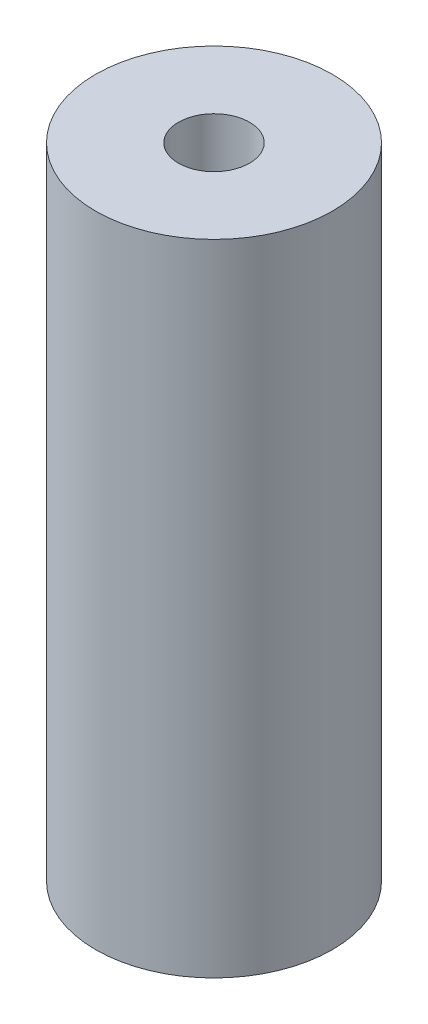
ISO-10303-21;
HEADER;
FILE_DESCRIPTION(('STEP AP214'),'2;1');
FILE_NAME('part.step','',(''),(''),'','','');
FILE_SCHEMA(('AUTOMOTIVE_DESIGN { 1 0 10303 214 1 1 1 1 }'));
ENDSEC;
DATA;
#1=APPLICATION_CONTEXT('core data for automotive mechanical design processes');
#2=APPLICATION_PROTOCOL_DEFINITION('international standard','automotive_design',2000,#1);
#3=PRODUCT_CONTEXT('',#1,'mechanical');
#4=PRODUCT('Part','Part','',(#3));
#5=PRODUCT_RELATED_PRODUCT_CATEGORY('part','',(#4));
#6=PRODUCT_DEFINITION_FORMATION('','',#4);
#7=PRODUCT_DEFINITION_CONTEXT('part definition',#1,'design');
#8=PRODUCT_DEFINITION('design','',#6,#7);
#9=PRODUCT_DEFINITION_SHAPE('','',#8);
#10=(LENGTH_UNIT() NAMED_UNIT(*) SI_UNIT(.MILLI.,.METRE.));
#11=(NAMED_UNIT(*) PLANE_ANGLE_UNIT() SI_UNIT($,.RADIAN.));
#12=(NAMED_UNIT(*) SI_UNIT($,.STERADIAN.) SOLID_ANGLE_UNIT());
#13=UNCERTAINTY_MEASURE_WITH_UNIT(LENGTH_MEASURE(1.E-05),#10,'distance_accuracy_value','');
#14=(GEOMETRIC_REPRESENTATION_CONTEXT(3) GLOBAL_UNCERTAINTY_ASSIGNED_CONTEXT((#13)) GLOBAL_UNIT_ASSIGNED_CONTEXT((#10,
#11,#12)) REPRESENTATION_CONTEXT('',''));
#15=CARTESIAN_POINT('',(0.,0.,0.));
#16=DIRECTION('',(0.,0.,1.));
#17=DIRECTION('',(1.,0.,0.));
#18=AXIS2_PLACEMENT_3D('',#15,#16,#17);
#19=CARTESIAN_POINT('',(0.,27.,0.));
#20=DIRECTION('',(0.,-1.,0.));
#21=DIRECTION('',(0.,0.,-1.));
#22=AXIS2_PLACEMENT_3D('',#19,#20,#21);
#23=CYLINDRICAL_SURFACE('',#22,5.);
#24=CARTESIAN_POINT('',(0.,27.,0.));
#25=DIRECTION('',(0.,1.,0.));
#26=DIRECTION('',(0.,0.,1.));
#27=AXIS2_PLACEMENT_3D('',#24,#25,#26);
#28=CIRCLE('',#27,5.);
#29=CARTESIAN_POINT('',(0.,27.,5.));
#30=VERTEX_POINT('',#29);
#31=EDGE_CURVE('E10',#30,#30,#28,.T.);
#32=ORIENTED_EDGE('',*,*,#31,.F.);
#33=EDGE_LOOP('',(#32));
#34=FACE_BOUND('',#33,.T.);
#35=CARTESIAN_POINT('',(0.,0.,0.));
#36=DIRECTION('',(0.,1.,0.));
#37=DIRECTION('',(0.,0.,1.));
#38=AXIS2_PLACEMENT_3D('',#35,#36,#37);
#39=CIRCLE('',#38,5.);
#40=CARTESIAN_POINT('',(0.,0.,5.));
#41=VERTEX_POINT('',#40);
#42=EDGE_CURVE('E33',#41,#41,#39,.T.);
#43=ORIENTED_EDGE('',*,*,#42,.T.);
#44=EDGE_LOOP('',(#43));
#45=FACE_BOUND('',#44,.T.);
#46=ADVANCED_FACE('F30',(#34,#45),#23,.T.);
#47=CARTESIAN_POINT('',(0.,27.,0.));
#48=DIRECTION('',(0.,1.,0.));
#49=DIRECTION('',(0.,0.,1.));
#50=AXIS2_PLACEMENT_3D('',#47,#48,#49);
#51=PLANE('',#50);
#52=CARTESIAN_POINT('',(0.,27.,0.));
#53=DIRECTION('',(0.,1.,0.));
#54=DIRECTION('',(0.,0.,1.));
#55=AXIS2_PLACEMENT_3D('',#52,#53,#54);
#56=CIRCLE('',#55,1.5);
#57=CARTESIAN_POINT('',(0.,27.,1.5));
#58=VERTEX_POINT('',#57);
#59=EDGE_CURVE('E42',#58,#58,#56,.T.);
#60=ORIENTED_EDGE('',*,*,#59,.F.);
#61=EDGE_LOOP('',(#60));
#62=FACE_BOUND('',#61,.T.);
#63=ORIENTED_EDGE('',*,*,#31,.T.);
#64=EDGE_LOOP('',(#63));
#65=FACE_BOUND('',#64,.T.);
#66=ADVANCED_FACE('F67',(#62,#65),#51,.T.);
#67=CARTESIAN_POINT('',(0.,0.,0.));
#68=DIRECTION('',(0.,1.,0.));
#69=DIRECTION('',(0.,0.,1.));
#70=AXIS2_PLACEMENT_3D('',#67,#68,#69);
#71=PLANE('',#70);
#72=CARTESIAN_POINT('',(0.,0.,0.));
#73=DIRECTION('',(0.,-1.,0.));
#74=DIRECTION('',(0.,0.,-1.));
#75=AXIS2_PLACEMENT_3D('',#72,#73,#74);
#76=CIRCLE('',#75,1.5);
#77=CARTESIAN_POINT('',(0.,0.,-1.5));
#78=VERTEX_POINT('',#77);
#79=EDGE_CURVE('E48',#78,#78,#76,.T.);
#80=ORIENTED_EDGE('',*,*,#79,.F.);
#81=EDGE_LOOP('',(#80));
#82=FACE_BOUND('',#81,.T.);
#83=ORIENTED_EDGE('',*,*,#42,.F.);
#84=EDGE_LOOP('',(#83));
#85=FACE_BOUND('',#84,.T.);
#86=ADVANCED_FACE('F63',(#82,#85),#71,.F.);
#87=CARTESIAN_POINT('',(0.,22.,0.));
#88=DIRECTION('',(0.,1.,0.));
#89=DIRECTION('',(0.,0.,1.));
#90=AXIS2_PLACEMENT_3D('',#87,#88,#89);
#91=CYLINDRICAL_SURFACE('',#90,1.5);
#92=CARTESIAN_POINT('',(0.,22.,0.));
#93=DIRECTION('',(0.,1.,0.));
#94=DIRECTION('',(0.,0.,1.));
#95=AXIS2_PLACEMENT_3D('',#92,#93,#94);
#96=CIRCLE('',#95,1.5);
#97=CARTESIAN_POINT('',(0.,22.,1.5));
#98=VERTEX_POINT('',#97);
#99=EDGE_CURVE('E40',#98,#98,#96,.T.);
#100=ORIENTED_EDGE('',*,*,#99,.F.);
#101=EDGE_LOOP('',(#100));
#102=FACE_BOUND('',#101,.T.);
#103=ORIENTED_EDGE('',*,*,#59,.T.);
#104=EDGE_LOOP('',(#103));
#105=FACE_BOUND('',#104,.T.);
#106=ADVANCED_FACE('F66',(#102,#105),#91,.F.);
#107=CARTESIAN_POINT('',(0.,22.,0.));
#108=DIRECTION('',(0.,1.,0.));
#109=DIRECTION('',(0.,0.,1.));
#110=AXIS2_PLACEMENT_3D('',#107,#108,#109);
#111=PLANE('',#110);
#112=ORIENTED_EDGE('',*,*,#99,.T.);
#113=EDGE_LOOP('',(#112));
#114=FACE_BOUND('',#113,.T.);
#115=ADVANCED_FACE('F59',(#114),#111,.T.);
#116=CARTESIAN_POINT('',(0.,5.,0.));
#117=DIRECTION('',(0.,-1.,0.));
#118=DIRECTION('',(0.,0.,-1.));
#119=AXIS2_PLACEMENT_3D('',#116,#117,#118);
#120=CYLINDRICAL_SURFACE('',#119,1.5);
#121=CARTESIAN_POINT('',(0.,5.,0.));
#122=DIRECTION('',(0.,-1.,0.));
#123=DIRECTION('',(0.,0.,-1.));
#124=AXIS2_PLACEMENT_3D('',#121,#122,#123);
#125=CIRCLE('',#124,1.5);
#126=CARTESIAN_POINT('',(0.,5.,-1.5));
#127=VERTEX_POINT('',#126);
#128=EDGE_CURVE('E45',#127,#127,#125,.T.);
#129=ORIENTED_EDGE('',*,*,#128,.F.);
#130=EDGE_LOOP('',(#129));
#131=FACE_BOUND('',#130,.T.);
#132=ORIENTED_EDGE('',*,*,#79,.T.);
#133=EDGE_LOOP('',(#132));
#134=FACE_BOUND('',#133,.T.);
#135=ADVANCED_FACE('F56',(#131,#134),#120,.F.);
#136=CARTESIAN_POINT('',(0.,5.,0.));
#137=DIRECTION('',(0.,-1.,0.));
#138=DIRECTION('',(0.,0.,-1.));
#139=AXIS2_PLACEMENT_3D('',#136,#137,#138);
#140=PLANE('',#139);
#141=ORIENTED_EDGE('',*,*,#128,.T.);
#142=EDGE_LOOP('',(#141));
#143=FACE_BOUND('',#142,.T.);
#144=ADVANCED_FACE('F54',(#143),#140,.T.);
#145=CLOSED_SHELL('',(#46,#66,#86,#106,#115,#135,#144));
#146=MANIFOLD_SOLID_BREP('B2',#145);
#147=ADVANCED_BREP_SHAPE_REPRESENTATION('',(#18,#146),#14);
#148=SHAPE_DEFINITION_REPRESENTATION(#9,#147);
ENDSEC;
END-ISO-10303-21;
